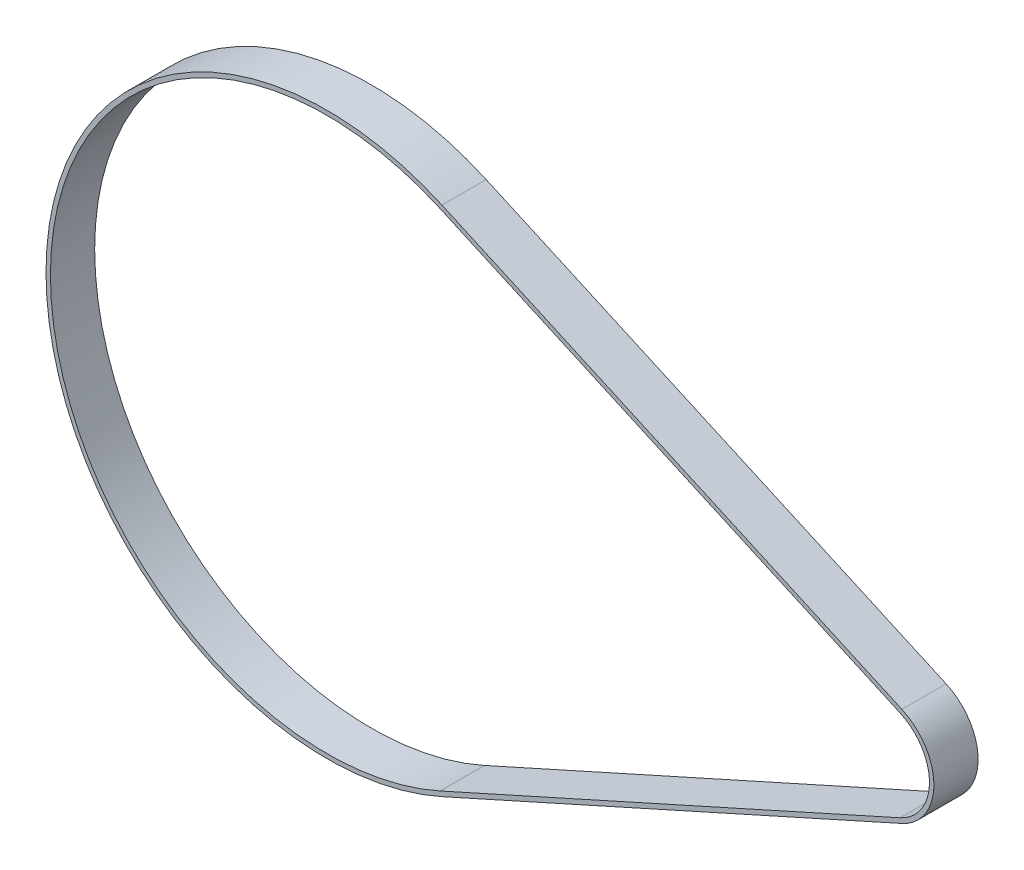
ISO-10303-21;
HEADER;
FILE_DESCRIPTION(('STEP AP214'),'2;1');
FILE_NAME('part.step','',(''),(''),'','','');
FILE_SCHEMA(('AUTOMOTIVE_DESIGN { 1 0 10303 214 1 1 1 1 }'));
ENDSEC;
DATA;
#1=APPLICATION_CONTEXT('core data for automotive mechanical design processes');
#2=APPLICATION_PROTOCOL_DEFINITION('international standard','automotive_design',2000,#1);
#3=PRODUCT_CONTEXT('',#1,'mechanical');
#4=PRODUCT('Part','Part','',(#3));
#5=PRODUCT_RELATED_PRODUCT_CATEGORY('part','',(#4));
#6=PRODUCT_DEFINITION_FORMATION('','',#4);
#7=PRODUCT_DEFINITION_CONTEXT('part definition',#1,'design');
#8=PRODUCT_DEFINITION('design','',#6,#7);
#9=PRODUCT_DEFINITION_SHAPE('','',#8);
#10=(LENGTH_UNIT() NAMED_UNIT(*) SI_UNIT(.MILLI.,.METRE.));
#11=(NAMED_UNIT(*) PLANE_ANGLE_UNIT() SI_UNIT($,.RADIAN.));
#12=(NAMED_UNIT(*) SI_UNIT($,.STERADIAN.) SOLID_ANGLE_UNIT());
#13=UNCERTAINTY_MEASURE_WITH_UNIT(LENGTH_MEASURE(1.E-05),#10,'distance_accuracy_value','');
#14=(GEOMETRIC_REPRESENTATION_CONTEXT(3) GLOBAL_UNCERTAINTY_ASSIGNED_CONTEXT((#13)) GLOBAL_UNIT_ASSIGNED_CONTEXT((#10,
#11,#12)) REPRESENTATION_CONTEXT('',''));
#15=CARTESIAN_POINT('',(0.,0.,0.));
#16=DIRECTION('',(0.,0.,1.));
#17=DIRECTION('',(1.,0.,0.));
#18=AXIS2_PLACEMENT_3D('',#15,#16,#17);
#19=CARTESIAN_POINT('',(1.05155510034002E-12,9.7072269236961E-13,10.));
#20=DIRECTION('',(0.,0.,-1.));
#21=DIRECTION('',(-1.,0.,0.));
#22=AXIS2_PLACEMENT_3D('',#19,#20,#21);
#23=PLANE('',#22);
#24=CARTESIAN_POINT('',(1.05155510034002E-12,9.7072269236961E-13,10.));
#25=DIRECTION('',(0.,0.,-1.));
#26=DIRECTION('',(-1.,0.,0.));
#27=AXIS2_PLACEMENT_3D('',#24,#25,#26);
#28=CIRCLE('',#27,127.);
#29=CARTESIAN_POINT('',(52.0699999999999,115.834861332849,10.));
#30=VERTEX_POINT('',#29);
#31=CARTESIAN_POINT('',(52.0700000000027,-115.834861332846,10.));
#32=VERTEX_POINT('',#31);
#33=EDGE_CURVE('E160',#30,#32,#28,.F.);
#34=ORIENTED_EDGE('',*,*,#33,.T.);
#35=DIRECTION('',(0.91208552230588,0.410000000000013,0.));
#36=VECTOR('',#35,1.);
#37=CARTESIAN_POINT('',(52.0700000000027,-115.834861332846,10.));
#38=LINE('',#37,#36);
#39=CARTESIAN_POINT('',(260.045,-22.3460952964901,10.));
#40=VERTEX_POINT('',#39);
#41=EDGE_CURVE('E163',#32,#40,#38,.T.);
#42=ORIENTED_EDGE('',*,*,#41,.T.);
#43=CARTESIAN_POINT('',(250.,3.99595966148385E-12,10.));
#44=DIRECTION('',(0.,0.,-1.));
#45=DIRECTION('',(-1.,0.,0.));
#46=AXIS2_PLACEMENT_3D('',#43,#44,#45);
#47=CIRCLE('',#46,24.5);
#48=CARTESIAN_POINT('',(260.045,22.3460952964983,10.));
#49=VERTEX_POINT('',#48);
#50=EDGE_CURVE('E166',#40,#49,#47,.F.);
#51=ORIENTED_EDGE('',*,*,#50,.T.);
#52=DIRECTION('',(-0.91208552230589,0.409999999999991,0.));
#53=VECTOR('',#52,1.);
#54=CARTESIAN_POINT('',(52.0699999999999,115.834861332849,10.));
#55=LINE('',#54,#53);
#56=EDGE_CURVE('E168',#49,#30,#55,.T.);
#57=ORIENTED_EDGE('',*,*,#56,.T.);
#58=EDGE_LOOP('',(#34,#42,#51,#57));
#59=FACE_BOUND('',#58,.T.);
#60=CARTESIAN_POINT('',(1.05155510034002E-12,9.7072269236961E-13,10.));
#61=DIRECTION('',(0.,0.,1.));
#62=DIRECTION('',(-1.,0.,0.));
#63=AXIS2_PLACEMENT_3D('',#60,#61,#62);
#64=CIRCLE('',#63,125.);
#65=CARTESIAN_POINT('',(51.2499999999999,114.010690288237,10.));
#66=VERTEX_POINT('',#65);
#67=CARTESIAN_POINT('',(51.2500000000026,-114.010690288234,10.));
#68=VERTEX_POINT('',#67);
#69=EDGE_CURVE('E124',#66,#68,#64,.T.);
#70=ORIENTED_EDGE('',*,*,#69,.F.);
#71=DIRECTION('',(-0.91208552230589,0.409999999999991,0.));
#72=VECTOR('',#71,1.);
#73=CARTESIAN_POINT('',(51.2499999999999,114.010690288237,10.));
#74=LINE('',#73,#72);
#75=CARTESIAN_POINT('',(259.225,20.5219242518865,10.));
#76=VERTEX_POINT('',#75);
#77=EDGE_CURVE('E146',#76,#66,#74,.T.);
#78=ORIENTED_EDGE('',*,*,#77,.F.);
#79=CARTESIAN_POINT('',(250.,3.99595966148385E-12,10.));
#80=DIRECTION('',(0.,0.,1.));
#81=DIRECTION('',(-1.,0.,0.));
#82=AXIS2_PLACEMENT_3D('',#79,#80,#81);
#83=CIRCLE('',#82,22.5);
#84=CARTESIAN_POINT('',(259.225,-20.5219242518783,10.));
#85=VERTEX_POINT('',#84);
#86=EDGE_CURVE('E144',#85,#76,#83,.T.);
#87=ORIENTED_EDGE('',*,*,#86,.F.);
#88=DIRECTION('',(0.91208552230588,0.410000000000013,0.));
#89=VECTOR('',#88,1.);
#90=CARTESIAN_POINT('',(259.225,-20.5219242518783,10.));
#91=LINE('',#90,#89);
#92=EDGE_CURVE('E132',#68,#85,#91,.T.);
#93=ORIENTED_EDGE('',*,*,#92,.F.);
#94=EDGE_LOOP('',(#70,#78,#87,#93));
#95=FACE_BOUND('',#94,.T.);
#96=ADVANCED_FACE('F59',(#59,#95),#23,.F.);
#97=CARTESIAN_POINT('',(1.05155510034002E-12,9.7072269236961E-13,-10.));
#98=DIRECTION('',(0.,0.,-1.));
#99=DIRECTION('',(-1.,0.,0.));
#100=AXIS2_PLACEMENT_3D('',#97,#98,#99);
#101=PLANE('',#100);
#102=CARTESIAN_POINT('',(1.05155510034002E-12,9.7072269236961E-13,-10.));
#103=DIRECTION('',(0.,0.,-1.));
#104=DIRECTION('',(-1.,0.,0.));
#105=AXIS2_PLACEMENT_3D('',#102,#103,#104);
#106=CIRCLE('',#105,127.);
#107=CARTESIAN_POINT('',(52.0699999999999,115.834861332849,-10.));
#108=VERTEX_POINT('',#107);
#109=CARTESIAN_POINT('',(52.0700000000027,-115.834861332846,-10.));
#110=VERTEX_POINT('',#109);
#111=EDGE_CURVE('E140',#108,#110,#106,.F.);
#112=ORIENTED_EDGE('',*,*,#111,.F.);
#113=DIRECTION('',(-0.91208552230589,0.409999999999991,0.));
#114=VECTOR('',#113,1.);
#115=CARTESIAN_POINT('',(52.0699999999999,115.834861332849,-10.));
#116=LINE('',#115,#114);
#117=CARTESIAN_POINT('',(260.045,22.3460952964983,-10.));
#118=VERTEX_POINT('',#117);
#119=EDGE_CURVE('E164',#118,#108,#116,.T.);
#120=ORIENTED_EDGE('',*,*,#119,.F.);
#121=CARTESIAN_POINT('',(250.,3.99595966148385E-12,-10.));
#122=DIRECTION('',(0.,0.,-1.));
#123=DIRECTION('',(-1.,0.,0.));
#124=AXIS2_PLACEMENT_3D('',#121,#122,#123);
#125=CIRCLE('',#124,24.5);
#126=CARTESIAN_POINT('',(260.045,-22.3460952964901,-10.));
#127=VERTEX_POINT('',#126);
#128=EDGE_CURVE('E175',#127,#118,#125,.F.);
#129=ORIENTED_EDGE('',*,*,#128,.F.);
#130=DIRECTION('',(0.91208552230588,0.410000000000013,0.));
#131=VECTOR('',#130,1.);
#132=CARTESIAN_POINT('',(52.0700000000027,-115.834861332846,-10.));
#133=LINE('',#132,#131);
#134=EDGE_CURVE('E173',#110,#127,#133,.T.);
#135=ORIENTED_EDGE('',*,*,#134,.F.);
#136=EDGE_LOOP('',(#112,#120,#129,#135));
#137=FACE_BOUND('',#136,.T.);
#138=DIRECTION('',(-0.91208552230589,0.409999999999991,0.));
#139=VECTOR('',#138,1.);
#140=CARTESIAN_POINT('',(51.2499999999999,114.010690288237,-10.));
#141=LINE('',#140,#139);
#142=CARTESIAN_POINT('',(259.225,20.5219242518865,-10.));
#143=VERTEX_POINT('',#142);
#144=CARTESIAN_POINT('',(51.2499999999999,114.010690288237,-10.));
#145=VERTEX_POINT('',#144);
#146=EDGE_CURVE('E133',#143,#145,#141,.T.);
#147=ORIENTED_EDGE('',*,*,#146,.T.);
#148=CARTESIAN_POINT('',(1.05155510034002E-12,9.7072269236961E-13,-10.));
#149=DIRECTION('',(0.,0.,1.));
#150=DIRECTION('',(-1.,0.,0.));
#151=AXIS2_PLACEMENT_3D('',#148,#149,#150);
#152=CIRCLE('',#151,125.);
#153=CARTESIAN_POINT('',(51.2500000000026,-114.010690288234,-10.));
#154=VERTEX_POINT('',#153);
#155=EDGE_CURVE('E82',#145,#154,#152,.T.);
#156=ORIENTED_EDGE('',*,*,#155,.T.);
#157=DIRECTION('',(0.91208552230588,0.410000000000013,0.));
#158=VECTOR('',#157,1.);
#159=CARTESIAN_POINT('',(259.225,-20.5219242518783,-10.));
#160=LINE('',#159,#158);
#161=CARTESIAN_POINT('',(259.225,-20.5219242518783,-10.));
#162=VERTEX_POINT('',#161);
#163=EDGE_CURVE('E139',#154,#162,#160,.T.);
#164=ORIENTED_EDGE('',*,*,#163,.T.);
#165=CARTESIAN_POINT('',(250.,3.99595966148385E-12,-10.));
#166=DIRECTION('',(0.,0.,1.));
#167=DIRECTION('',(-1.,0.,0.));
#168=AXIS2_PLACEMENT_3D('',#165,#166,#167);
#169=CIRCLE('',#168,22.5);
#170=EDGE_CURVE('E152',#162,#143,#169,.T.);
#171=ORIENTED_EDGE('',*,*,#170,.T.);
#172=EDGE_LOOP('',(#147,#156,#164,#171));
#173=FACE_BOUND('',#172,.T.);
#174=ADVANCED_FACE('F193',(#137,#173),#101,.T.);
#175=CARTESIAN_POINT('',(1.05155510034002E-12,9.7072269236961E-13,10.));
#176=DIRECTION('',(0.,0.,-1.));
#177=DIRECTION('',(-1.,0.,0.));
#178=AXIS2_PLACEMENT_3D('',#175,#176,#177);
#179=CYLINDRICAL_SURFACE('',#178,127.);
#180=ORIENTED_EDGE('',*,*,#111,.T.);
#181=DIRECTION('',(0.,0.,-1.));
#182=VECTOR('',#181,1.);
#183=CARTESIAN_POINT('',(52.0700000000027,-115.834861332846,10.));
#184=LINE('',#183,#182);
#185=EDGE_CURVE('E12',#32,#110,#184,.T.);
#186=ORIENTED_EDGE('',*,*,#185,.F.);
#187=ORIENTED_EDGE('',*,*,#33,.F.);
#188=DIRECTION('',(0.,0.,-1.));
#189=VECTOR('',#188,1.);
#190=CARTESIAN_POINT('',(52.0699999999999,115.834861332849,10.));
#191=LINE('',#190,#189);
#192=EDGE_CURVE('E170',#30,#108,#191,.T.);
#193=ORIENTED_EDGE('',*,*,#192,.T.);
#194=EDGE_LOOP('',(#180,#186,#187,#193));
#195=FACE_BOUND('',#194,.T.);
#196=ADVANCED_FACE('F61',(#195),#179,.T.);
#197=CARTESIAN_POINT('',(52.0700000000027,-115.834861332846,10.));
#198=DIRECTION('',(-0.410000000000013,0.91208552230588,0.));
#199=DIRECTION('',(-0.91208552230588,-0.410000000000013,0.));
#200=AXIS2_PLACEMENT_3D('',#197,#198,#199);
#201=PLANE('',#200);
#202=ORIENTED_EDGE('',*,*,#134,.T.);
#203=DIRECTION('',(0.,0.,-1.));
#204=VECTOR('',#203,1.);
#205=CARTESIAN_POINT('',(260.045,-22.3460952964901,10.));
#206=LINE('',#205,#204);
#207=EDGE_CURVE('E67',#40,#127,#206,.T.);
#208=ORIENTED_EDGE('',*,*,#207,.F.);
#209=ORIENTED_EDGE('',*,*,#41,.F.);
#210=ORIENTED_EDGE('',*,*,#185,.T.);
#211=EDGE_LOOP('',(#202,#208,#209,#210));
#212=FACE_BOUND('',#211,.T.);
#213=ADVANCED_FACE('F203',(#212),#201,.F.);
#214=CARTESIAN_POINT('',(250.,3.99595966148385E-12,10.));
#215=DIRECTION('',(0.,0.,-1.));
#216=DIRECTION('',(-1.,0.,0.));
#217=AXIS2_PLACEMENT_3D('',#214,#215,#216);
#218=CYLINDRICAL_SURFACE('',#217,24.5);
#219=ORIENTED_EDGE('',*,*,#128,.T.);
#220=DIRECTION('',(0.,0.,-1.));
#221=VECTOR('',#220,1.);
#222=CARTESIAN_POINT('',(260.045,22.3460952964983,10.));
#223=LINE('',#222,#221);
#224=EDGE_CURVE('E180',#49,#118,#223,.T.);
#225=ORIENTED_EDGE('',*,*,#224,.F.);
#226=ORIENTED_EDGE('',*,*,#50,.F.);
#227=ORIENTED_EDGE('',*,*,#207,.T.);
#228=EDGE_LOOP('',(#219,#225,#226,#227));
#229=FACE_BOUND('',#228,.T.);
#230=ADVANCED_FACE('F187',(#229),#218,.T.);
#231=CARTESIAN_POINT('',(52.0699999999999,115.834861332849,10.));
#232=DIRECTION('',(-0.409999999999991,-0.91208552230589,0.));
#233=DIRECTION('',(0.91208552230589,-0.409999999999991,0.));
#234=AXIS2_PLACEMENT_3D('',#231,#232,#233);
#235=PLANE('',#234);
#236=ORIENTED_EDGE('',*,*,#119,.T.);
#237=ORIENTED_EDGE('',*,*,#192,.F.);
#238=ORIENTED_EDGE('',*,*,#56,.F.);
#239=ORIENTED_EDGE('',*,*,#224,.T.);
#240=EDGE_LOOP('',(#236,#237,#238,#239));
#241=FACE_BOUND('',#240,.T.);
#242=ADVANCED_FACE('F197',(#241),#235,.F.);
#243=CARTESIAN_POINT('',(1.05155510034002E-12,9.7072269236961E-13,10.));
#244=DIRECTION('',(0.,0.,-1.));
#245=DIRECTION('',(-1.,0.,0.));
#246=AXIS2_PLACEMENT_3D('',#243,#244,#245);
#247=CYLINDRICAL_SURFACE('',#246,125.);
#248=ORIENTED_EDGE('',*,*,#155,.F.);
#249=DIRECTION('',(0.,0.,-1.));
#250=VECTOR('',#249,1.);
#251=CARTESIAN_POINT('',(51.2499999999999,114.010690288237,10.));
#252=LINE('',#251,#250);
#253=EDGE_CURVE('E128',#66,#145,#252,.T.);
#254=ORIENTED_EDGE('',*,*,#253,.F.);
#255=ORIENTED_EDGE('',*,*,#69,.T.);
#256=DIRECTION('',(0.,0.,-1.));
#257=VECTOR('',#256,1.);
#258=CARTESIAN_POINT('',(51.2500000000026,-114.010690288234,10.));
#259=LINE('',#258,#257);
#260=EDGE_CURVE('E127',#68,#154,#259,.T.);
#261=ORIENTED_EDGE('',*,*,#260,.T.);
#262=EDGE_LOOP('',(#248,#254,#255,#261));
#263=FACE_BOUND('',#262,.T.);
#264=ADVANCED_FACE('F126',(#263),#247,.F.);
#265=CARTESIAN_POINT('',(259.225,-20.5219242518783,10.));
#266=DIRECTION('',(-0.410000000000013,0.91208552230588,0.));
#267=DIRECTION('',(-0.91208552230588,-0.410000000000013,0.));
#268=AXIS2_PLACEMENT_3D('',#265,#266,#267);
#269=PLANE('',#268);
#270=ORIENTED_EDGE('',*,*,#163,.F.);
#271=ORIENTED_EDGE('',*,*,#260,.F.);
#272=ORIENTED_EDGE('',*,*,#92,.T.);
#273=DIRECTION('',(0.,0.,-1.));
#274=VECTOR('',#273,1.);
#275=CARTESIAN_POINT('',(259.225,-20.5219242518783,10.));
#276=LINE('',#275,#274);
#277=EDGE_CURVE('E141',#85,#162,#276,.T.);
#278=ORIENTED_EDGE('',*,*,#277,.T.);
#279=EDGE_LOOP('',(#270,#271,#272,#278));
#280=FACE_BOUND('',#279,.T.);
#281=ADVANCED_FACE('F136',(#280),#269,.T.);
#282=CARTESIAN_POINT('',(250.,3.99595966148385E-12,10.));
#283=DIRECTION('',(0.,0.,-1.));
#284=DIRECTION('',(-1.,0.,0.));
#285=AXIS2_PLACEMENT_3D('',#282,#283,#284);
#286=CYLINDRICAL_SURFACE('',#285,22.5);
#287=ORIENTED_EDGE('',*,*,#170,.F.);
#288=ORIENTED_EDGE('',*,*,#277,.F.);
#289=ORIENTED_EDGE('',*,*,#86,.T.);
#290=DIRECTION('',(0.,0.,-1.));
#291=VECTOR('',#290,1.);
#292=CARTESIAN_POINT('',(259.225,20.5219242518865,10.));
#293=LINE('',#292,#291);
#294=EDGE_CURVE('E74',#76,#143,#293,.T.);
#295=ORIENTED_EDGE('',*,*,#294,.T.);
#296=EDGE_LOOP('',(#287,#288,#289,#295));
#297=FACE_BOUND('',#296,.T.);
#298=ADVANCED_FACE('F226',(#297),#286,.F.);
#299=CARTESIAN_POINT('',(51.2499999999999,114.010690288237,10.));
#300=DIRECTION('',(-0.409999999999991,-0.91208552230589,0.));
#301=DIRECTION('',(0.91208552230589,-0.409999999999991,0.));
#302=AXIS2_PLACEMENT_3D('',#299,#300,#301);
#303=PLANE('',#302);
#304=ORIENTED_EDGE('',*,*,#146,.F.);
#305=ORIENTED_EDGE('',*,*,#294,.F.);
#306=ORIENTED_EDGE('',*,*,#77,.T.);
#307=ORIENTED_EDGE('',*,*,#253,.T.);
#308=EDGE_LOOP('',(#304,#305,#306,#307));
#309=FACE_BOUND('',#308,.T.);
#310=ADVANCED_FACE('F230',(#309),#303,.T.);
#311=CLOSED_SHELL('',(#96,#174,#196,#213,#230,#242,#264,#281,#298,#310));
#312=MANIFOLD_SOLID_BREP('B2',#311);
#313=ADVANCED_BREP_SHAPE_REPRESENTATION('',(#18,#312),#14);
#314=SHAPE_DEFINITION_REPRESENTATION(#9,#313);
ENDSEC;
END-ISO-10303-21;
